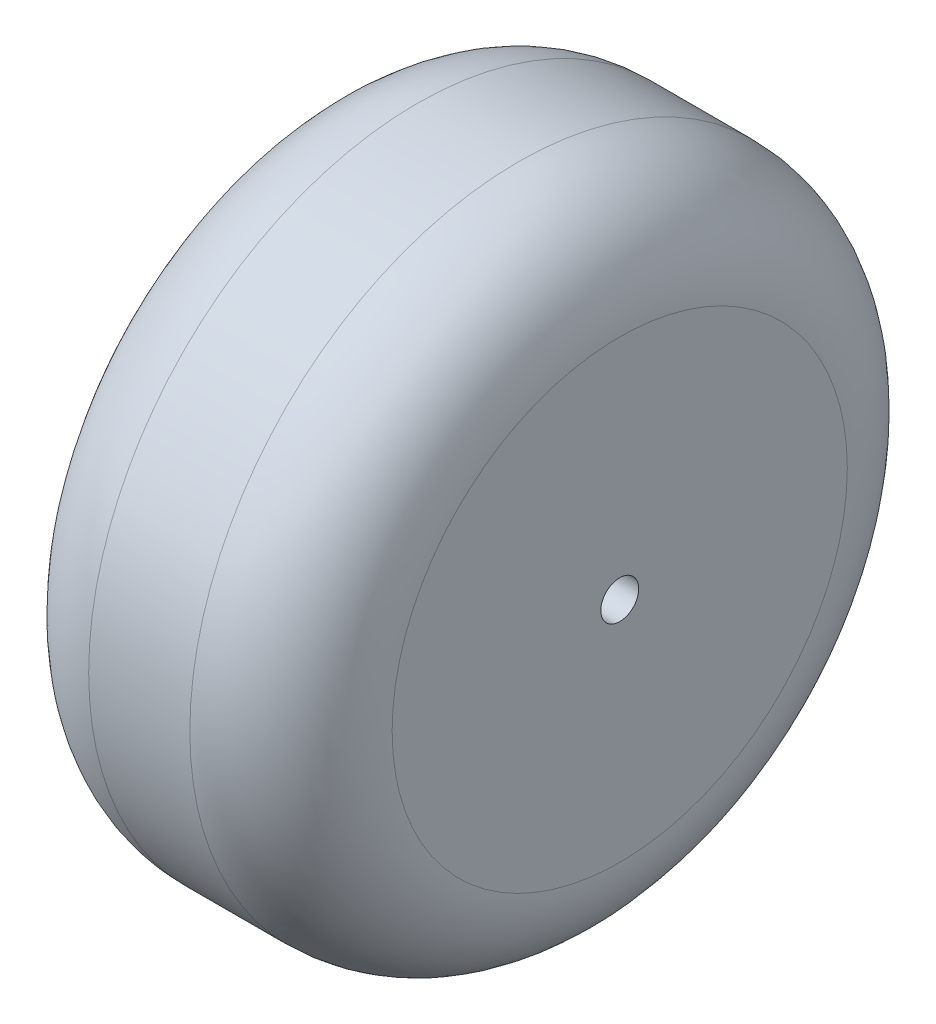
ISO-10303-21;
HEADER;
FILE_DESCRIPTION(('STEP AP214'),'2;1');
FILE_NAME('part.step','',(''),(''),'','','');
FILE_SCHEMA(('AUTOMOTIVE_DESIGN { 1 0 10303 214 1 1 1 1 }'));
ENDSEC;
DATA;
#1=APPLICATION_CONTEXT('core data for automotive mechanical design processes');
#2=APPLICATION_PROTOCOL_DEFINITION('international standard','automotive_design',2000,#1);
#3=PRODUCT_CONTEXT('',#1,'mechanical');
#4=PRODUCT('Part','Part','',(#3));
#5=PRODUCT_RELATED_PRODUCT_CATEGORY('part','',(#4));
#6=PRODUCT_DEFINITION_FORMATION('','',#4);
#7=PRODUCT_DEFINITION_CONTEXT('part definition',#1,'design');
#8=PRODUCT_DEFINITION('design','',#6,#7);
#9=PRODUCT_DEFINITION_SHAPE('','',#8);
#10=(LENGTH_UNIT() NAMED_UNIT(*) SI_UNIT(.MILLI.,.METRE.));
#11=(NAMED_UNIT(*) PLANE_ANGLE_UNIT() SI_UNIT($,.RADIAN.));
#12=(NAMED_UNIT(*) SI_UNIT($,.STERADIAN.) SOLID_ANGLE_UNIT());
#13=UNCERTAINTY_MEASURE_WITH_UNIT(LENGTH_MEASURE(1.E-05),#10,'distance_accuracy_value','');
#14=(GEOMETRIC_REPRESENTATION_CONTEXT(3) GLOBAL_UNCERTAINTY_ASSIGNED_CONTEXT((#13)) GLOBAL_UNIT_ASSIGNED_CONTEXT((#10,
#11,#12)) REPRESENTATION_CONTEXT('',''));
#15=CARTESIAN_POINT('',(0.,0.,0.));
#16=DIRECTION('',(0.,0.,1.));
#17=DIRECTION('',(1.,0.,0.));
#18=AXIS2_PLACEMENT_3D('',#15,#16,#17);
#19=CARTESIAN_POINT('',(38.1,0.,0.));
#20=DIRECTION('',(-1.,0.,0.));
#21=DIRECTION('',(0.,0.,1.));
#22=AXIS2_PLACEMENT_3D('',#19,#20,#21);
#23=CYLINDRICAL_SURFACE('',#22,41.275);
#24=CARTESIAN_POINT('',(12.7,0.,0.));
#25=DIRECTION('',(1.,0.,0.));
#26=DIRECTION('',(0.,0.,-1.));
#27=AXIS2_PLACEMENT_3D('',#24,#25,#26);
#28=CIRCLE('',#27,41.275);
#29=CARTESIAN_POINT('',(12.7,0.,-41.275));
#30=VERTEX_POINT('',#29);
#31=EDGE_CURVE('E42',#30,#30,#28,.T.);
#32=ORIENTED_EDGE('',*,*,#31,.T.);
#33=EDGE_LOOP('',(#32));
#34=FACE_BOUND('',#33,.T.);
#35=CARTESIAN_POINT('',(25.4,0.,0.));
#36=DIRECTION('',(1.,0.,0.));
#37=DIRECTION('',(0.,0.,-1.));
#38=AXIS2_PLACEMENT_3D('',#35,#36,#37);
#39=CIRCLE('',#38,41.275);
#40=CARTESIAN_POINT('',(25.4,0.,-41.275));
#41=VERTEX_POINT('',#40);
#42=EDGE_CURVE('E46',#41,#41,#39,.F.);
#43=ORIENTED_EDGE('',*,*,#42,.T.);
#44=EDGE_LOOP('',(#43));
#45=FACE_BOUND('',#44,.T.);
#46=ADVANCED_FACE('F31',(#34,#45),#23,.T.);
#47=CARTESIAN_POINT('',(38.1,0.,0.));
#48=DIRECTION('',(1.,0.,0.));
#49=DIRECTION('',(0.,0.,-1.));
#50=AXIS2_PLACEMENT_3D('',#47,#48,#49);
#51=PLANE('',#50);
#52=CARTESIAN_POINT('',(38.1,0.,0.));
#53=DIRECTION('',(1.,0.,0.));
#54=DIRECTION('',(0.,0.,-1.));
#55=AXIS2_PLACEMENT_3D('',#52,#53,#54);
#56=CIRCLE('',#55,28.575);
#57=CARTESIAN_POINT('',(38.1,0.,-28.575));
#58=VERTEX_POINT('',#57);
#59=EDGE_CURVE('E10',#58,#58,#56,.T.);
#60=ORIENTED_EDGE('',*,*,#59,.T.);
#61=EDGE_LOOP('',(#60));
#62=FACE_BOUND('',#61,.T.);
#63=CARTESIAN_POINT('',(38.1,0.,0.));
#64=DIRECTION('',(1.,0.,0.));
#65=DIRECTION('',(0.,0.,-1.));
#66=AXIS2_PLACEMENT_3D('',#63,#64,#65);
#67=CIRCLE('',#66,2.38125);
#68=CARTESIAN_POINT('',(38.1,0.,-2.38125));
#69=VERTEX_POINT('',#68);
#70=EDGE_CURVE('E52',#69,#69,#67,.T.);
#71=ORIENTED_EDGE('',*,*,#70,.F.);
#72=EDGE_LOOP('',(#71));
#73=FACE_BOUND('',#72,.T.);
#74=ADVANCED_FACE('F67',(#62,#73),#51,.T.);
#75=CARTESIAN_POINT('',(0.,0.,0.));
#76=DIRECTION('',(1.,0.,0.));
#77=DIRECTION('',(0.,0.,-1.));
#78=AXIS2_PLACEMENT_3D('',#75,#76,#77);
#79=PLANE('',#78);
#80=CARTESIAN_POINT('',(0.,0.,0.));
#81=DIRECTION('',(1.,0.,0.));
#82=DIRECTION('',(0.,0.,-1.));
#83=AXIS2_PLACEMENT_3D('',#80,#81,#82);
#84=CIRCLE('',#83,28.575);
#85=CARTESIAN_POINT('',(0.,0.,-28.575));
#86=VERTEX_POINT('',#85);
#87=EDGE_CURVE('E38',#86,#86,#84,.F.);
#88=ORIENTED_EDGE('',*,*,#87,.T.);
#89=EDGE_LOOP('',(#88));
#90=FACE_BOUND('',#89,.T.);
#91=CARTESIAN_POINT('',(0.,0.,0.));
#92=DIRECTION('',(1.,0.,0.));
#93=DIRECTION('',(0.,0.,-1.));
#94=AXIS2_PLACEMENT_3D('',#91,#92,#93);
#95=CIRCLE('',#94,2.38125);
#96=CARTESIAN_POINT('',(0.,0.,-2.38125));
#97=VERTEX_POINT('',#96);
#98=EDGE_CURVE('E51',#97,#97,#95,.T.);
#99=ORIENTED_EDGE('',*,*,#98,.T.);
#100=EDGE_LOOP('',(#99));
#101=FACE_BOUND('',#100,.T.);
#102=ADVANCED_FACE('F58',(#90,#101),#79,.F.);
#103=CARTESIAN_POINT('',(0.,0.,0.));
#104=DIRECTION('',(1.,0.,0.));
#105=DIRECTION('',(0.,0.,-1.));
#106=AXIS2_PLACEMENT_3D('',#103,#104,#105);
#107=CYLINDRICAL_SURFACE('',#106,2.38125);
#108=ORIENTED_EDGE('',*,*,#98,.F.);
#109=EDGE_LOOP('',(#108));
#110=FACE_BOUND('',#109,.T.);
#111=ORIENTED_EDGE('',*,*,#70,.T.);
#112=EDGE_LOOP('',(#111));
#113=FACE_BOUND('',#112,.T.);
#114=ADVANCED_FACE('F60',(#110,#113),#107,.F.);
#115=CARTESIAN_POINT('',(12.7,0.,0.));
#116=DIRECTION('',(1.,0.,0.));
#117=DIRECTION('',(0.,0.,-1.));
#118=AXIS2_PLACEMENT_3D('',#115,#116,#117);
#119=TOROIDAL_SURFACE('',#118,28.575,12.7);
#120=ORIENTED_EDGE('',*,*,#87,.F.);
#121=EDGE_LOOP('',(#120));
#122=FACE_BOUND('',#121,.T.);
#123=ORIENTED_EDGE('',*,*,#31,.F.);
#124=EDGE_LOOP('',(#123));
#125=FACE_BOUND('',#124,.T.);
#126=ADVANCED_FACE('F63',(#122,#125),#119,.T.);
#127=CARTESIAN_POINT('',(25.4,0.,0.));
#128=DIRECTION('',(1.,0.,0.));
#129=DIRECTION('',(0.,0.,-1.));
#130=AXIS2_PLACEMENT_3D('',#127,#128,#129);
#131=TOROIDAL_SURFACE('',#130,28.575,12.7);
#132=ORIENTED_EDGE('',*,*,#42,.F.);
#133=EDGE_LOOP('',(#132));
#134=FACE_BOUND('',#133,.T.);
#135=ORIENTED_EDGE('',*,*,#59,.F.);
#136=EDGE_LOOP('',(#135));
#137=FACE_BOUND('',#136,.T.);
#138=ADVANCED_FACE('F33',(#134,#137),#131,.T.);
#139=CLOSED_SHELL('',(#46,#74,#102,#114,#126,#138));
#140=MANIFOLD_SOLID_BREP('B2',#139);
#141=ADVANCED_BREP_SHAPE_REPRESENTATION('',(#18,#140),#14);
#142=SHAPE_DEFINITION_REPRESENTATION(#9,#141);
ENDSEC;
END-ISO-10303-21;
